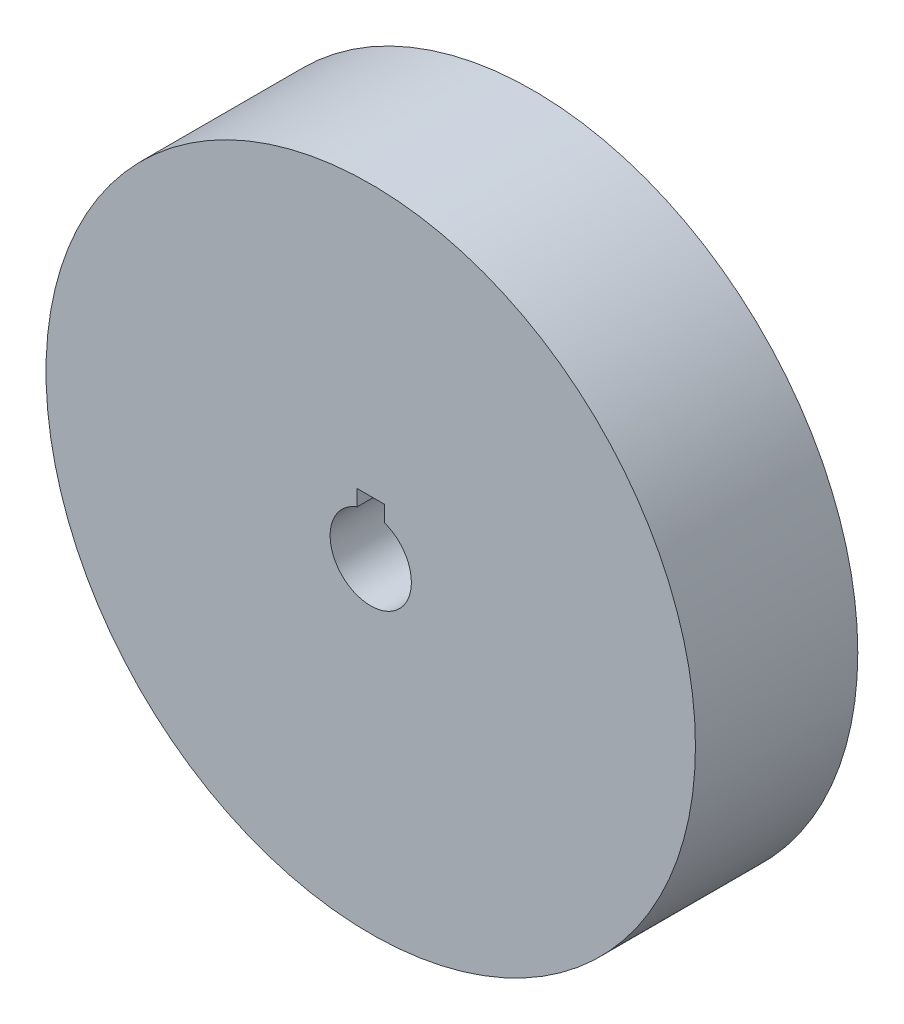
ISO-10303-21;
HEADER;
FILE_DESCRIPTION(('STEP AP214'),'2;1');
FILE_NAME('part.step','',(''),(''),'','','');
FILE_SCHEMA(('AUTOMOTIVE_DESIGN { 1 0 10303 214 1 1 1 1 }'));
ENDSEC;
DATA;
#1=APPLICATION_CONTEXT('core data for automotive mechanical design processes');
#2=APPLICATION_PROTOCOL_DEFINITION('international standard','automotive_design',2000,#1);
#3=PRODUCT_CONTEXT('',#1,'mechanical');
#4=PRODUCT('Part','Part','',(#3));
#5=PRODUCT_RELATED_PRODUCT_CATEGORY('part','',(#4));
#6=PRODUCT_DEFINITION_FORMATION('','',#4);
#7=PRODUCT_DEFINITION_CONTEXT('part definition',#1,'design');
#8=PRODUCT_DEFINITION('design','',#6,#7);
#9=PRODUCT_DEFINITION_SHAPE('','',#8);
#10=(LENGTH_UNIT() NAMED_UNIT(*) SI_UNIT(.MILLI.,.METRE.));
#11=(NAMED_UNIT(*) PLANE_ANGLE_UNIT() SI_UNIT($,.RADIAN.));
#12=(NAMED_UNIT(*) SI_UNIT($,.STERADIAN.) SOLID_ANGLE_UNIT());
#13=UNCERTAINTY_MEASURE_WITH_UNIT(LENGTH_MEASURE(1.E-05),#10,'distance_accuracy_value','');
#14=(GEOMETRIC_REPRESENTATION_CONTEXT(3) GLOBAL_UNCERTAINTY_ASSIGNED_CONTEXT((#13)) GLOBAL_UNIT_ASSIGNED_CONTEXT((#10,
#11,#12)) REPRESENTATION_CONTEXT('',''));
#15=CARTESIAN_POINT('',(0.,0.,0.));
#16=DIRECTION('',(0.,0.,1.));
#17=DIRECTION('',(1.,0.,0.));
#18=AXIS2_PLACEMENT_3D('',#15,#16,#17);
#19=CARTESIAN_POINT('',(0.,0.,38.1));
#20=DIRECTION('',(0.,0.,-1.));
#21=DIRECTION('',(-1.,0.,0.));
#22=AXIS2_PLACEMENT_3D('',#19,#20,#21);
#23=CYLINDRICAL_SURFACE('',#22,9.5377);
#24=CARTESIAN_POINT('',(0.,0.,0.));
#25=DIRECTION('',(0.,0.,1.));
#26=DIRECTION('',(1.,0.,0.));
#27=AXIS2_PLACEMENT_3D('',#24,#25,#26);
#28=CIRCLE('',#27,9.5377);
#29=CARTESIAN_POINT('',(-3.1877,8.98923189154669,0.));
#30=VERTEX_POINT('',#29);
#31=CARTESIAN_POINT('',(3.1877,8.98923189154669,0.));
#32=VERTEX_POINT('',#31);
#33=EDGE_CURVE('E104',#30,#32,#28,.T.);
#34=ORIENTED_EDGE('',*,*,#33,.F.);
#35=DIRECTION('',(0.,0.,-1.));
#36=VECTOR('',#35,1.);
#37=CARTESIAN_POINT('',(-3.1877,8.98923189154669,38.1));
#38=LINE('',#37,#36);
#39=CARTESIAN_POINT('',(-3.1877,8.98923189154669,38.1));
#40=VERTEX_POINT('',#39);
#41=EDGE_CURVE('E11',#40,#30,#38,.T.);
#42=ORIENTED_EDGE('',*,*,#41,.F.);
#43=CARTESIAN_POINT('',(0.,0.,38.1));
#44=DIRECTION('',(0.,0.,1.));
#45=DIRECTION('',(1.,0.,0.));
#46=AXIS2_PLACEMENT_3D('',#43,#44,#45);
#47=CIRCLE('',#46,9.5377);
#48=CARTESIAN_POINT('',(3.1877,8.98923189154669,38.1));
#49=VERTEX_POINT('',#48);
#50=EDGE_CURVE('E86',#40,#49,#47,.T.);
#51=ORIENTED_EDGE('',*,*,#50,.T.);
#52=DIRECTION('',(0.,0.,-1.));
#53=VECTOR('',#52,1.);
#54=CARTESIAN_POINT('',(3.1877,8.98923189154669,38.1));
#55=LINE('',#54,#53);
#56=EDGE_CURVE('E53',#49,#32,#55,.T.);
#57=ORIENTED_EDGE('',*,*,#56,.T.);
#58=EDGE_LOOP('',(#34,#42,#51,#57));
#59=FACE_BOUND('',#58,.T.);
#60=ADVANCED_FACE('F37',(#59),#23,.F.);
#61=CARTESIAN_POINT('',(-3.1877,0.,38.1));
#62=DIRECTION('',(-1.,0.,0.));
#63=DIRECTION('',(0.,0.,1.));
#64=AXIS2_PLACEMENT_3D('',#61,#62,#63);
#65=PLANE('',#64);
#66=DIRECTION('',(0.,1.,0.));
#67=VECTOR('',#66,1.);
#68=CARTESIAN_POINT('',(-3.1877,0.,0.));
#69=LINE('',#68,#67);
#70=CARTESIAN_POINT('',(-3.1877,12.7254,0.));
#71=VERTEX_POINT('',#70);
#72=EDGE_CURVE('E92',#30,#71,#69,.T.);
#73=ORIENTED_EDGE('',*,*,#72,.T.);
#74=DIRECTION('',(0.,0.,-1.));
#75=VECTOR('',#74,1.);
#76=CARTESIAN_POINT('',(-3.1877,12.7254,38.1));
#77=LINE('',#76,#75);
#78=CARTESIAN_POINT('',(-3.1877,12.7254,38.1));
#79=VERTEX_POINT('',#78);
#80=EDGE_CURVE('E45',#79,#71,#77,.T.);
#81=ORIENTED_EDGE('',*,*,#80,.F.);
#82=DIRECTION('',(0.,1.,0.));
#83=VECTOR('',#82,1.);
#84=CARTESIAN_POINT('',(-3.1877,0.,38.1));
#85=LINE('',#84,#83);
#86=EDGE_CURVE('E79',#40,#79,#85,.T.);
#87=ORIENTED_EDGE('',*,*,#86,.F.);
#88=ORIENTED_EDGE('',*,*,#41,.T.);
#89=EDGE_LOOP('',(#73,#81,#87,#88));
#90=FACE_BOUND('',#89,.T.);
#91=ADVANCED_FACE('F90',(#90),#65,.F.);
#92=CARTESIAN_POINT('',(0.,12.7254,38.1));
#93=DIRECTION('',(0.,1.,0.));
#94=DIRECTION('',(0.,0.,1.));
#95=AXIS2_PLACEMENT_3D('',#92,#93,#94);
#96=PLANE('',#95);
#97=DIRECTION('',(1.,0.,0.));
#98=VECTOR('',#97,1.);
#99=CARTESIAN_POINT('',(0.,12.7254,0.));
#100=LINE('',#99,#98);
#101=CARTESIAN_POINT('',(3.1877,12.7254,0.));
#102=VERTEX_POINT('',#101);
#103=EDGE_CURVE('E107',#71,#102,#100,.T.);
#104=ORIENTED_EDGE('',*,*,#103,.T.);
#105=DIRECTION('',(0.,0.,-1.));
#106=VECTOR('',#105,1.);
#107=CARTESIAN_POINT('',(3.1877,12.7254,38.1));
#108=LINE('',#107,#106);
#109=CARTESIAN_POINT('',(3.1877,12.7254,38.1));
#110=VERTEX_POINT('',#109);
#111=EDGE_CURVE('E67',#110,#102,#108,.T.);
#112=ORIENTED_EDGE('',*,*,#111,.F.);
#113=DIRECTION('',(1.,0.,0.));
#114=VECTOR('',#113,1.);
#115=CARTESIAN_POINT('',(0.,12.7254,38.1));
#116=LINE('',#115,#114);
#117=EDGE_CURVE('E85',#79,#110,#116,.T.);
#118=ORIENTED_EDGE('',*,*,#117,.F.);
#119=ORIENTED_EDGE('',*,*,#80,.T.);
#120=EDGE_LOOP('',(#104,#112,#118,#119));
#121=FACE_BOUND('',#120,.T.);
#122=ADVANCED_FACE('F95',(#121),#96,.F.);
#123=CARTESIAN_POINT('',(3.1877,0.,38.1));
#124=DIRECTION('',(-1.,0.,0.));
#125=DIRECTION('',(0.,0.,1.));
#126=AXIS2_PLACEMENT_3D('',#123,#124,#125);
#127=PLANE('',#126);
#128=DIRECTION('',(0.,1.,0.));
#129=VECTOR('',#128,1.);
#130=CARTESIAN_POINT('',(3.1877,0.,0.));
#131=LINE('',#130,#129);
#132=EDGE_CURVE('E109',#32,#102,#131,.T.);
#133=ORIENTED_EDGE('',*,*,#132,.F.);
#134=ORIENTED_EDGE('',*,*,#56,.F.);
#135=DIRECTION('',(0.,1.,0.));
#136=VECTOR('',#135,1.);
#137=CARTESIAN_POINT('',(3.1877,0.,38.1));
#138=LINE('',#137,#136);
#139=EDGE_CURVE('E96',#49,#110,#138,.T.);
#140=ORIENTED_EDGE('',*,*,#139,.T.);
#141=ORIENTED_EDGE('',*,*,#111,.T.);
#142=EDGE_LOOP('',(#133,#134,#140,#141));
#143=FACE_BOUND('',#142,.T.);
#144=ADVANCED_FACE('F118',(#143),#127,.T.);
#145=CARTESIAN_POINT('',(0.,0.,38.1));
#146=DIRECTION('',(0.,0.,-1.));
#147=DIRECTION('',(-1.,0.,0.));
#148=AXIS2_PLACEMENT_3D('',#145,#146,#147);
#149=CYLINDRICAL_SURFACE('',#148,76.2);
#150=CARTESIAN_POINT('',(0.,0.,38.1));
#151=DIRECTION('',(0.,0.,1.));
#152=DIRECTION('',(1.,0.,0.));
#153=AXIS2_PLACEMENT_3D('',#150,#151,#152);
#154=CIRCLE('',#153,76.2);
#155=CARTESIAN_POINT('',(76.2,0.,38.1));
#156=VERTEX_POINT('',#155);
#157=EDGE_CURVE('E98',#156,#156,#154,.T.);
#158=ORIENTED_EDGE('',*,*,#157,.F.);
#159=EDGE_LOOP('',(#158));
#160=FACE_BOUND('',#159,.T.);
#161=CARTESIAN_POINT('',(0.,0.,0.));
#162=DIRECTION('',(0.,0.,1.));
#163=DIRECTION('',(1.,0.,0.));
#164=AXIS2_PLACEMENT_3D('',#161,#162,#163);
#165=CIRCLE('',#164,76.2);
#166=CARTESIAN_POINT('',(76.2,0.,0.));
#167=VERTEX_POINT('',#166);
#168=EDGE_CURVE('E112',#167,#167,#165,.T.);
#169=ORIENTED_EDGE('',*,*,#168,.T.);
#170=EDGE_LOOP('',(#169));
#171=FACE_BOUND('',#170,.T.);
#172=ADVANCED_FACE('F120',(#160,#171),#149,.T.);
#173=CARTESIAN_POINT('',(0.,0.,38.1));
#174=DIRECTION('',(0.,0.,1.));
#175=DIRECTION('',(1.,0.,0.));
#176=AXIS2_PLACEMENT_3D('',#173,#174,#175);
#177=PLANE('',#176);
#178=ORIENTED_EDGE('',*,*,#50,.F.);
#179=ORIENTED_EDGE('',*,*,#86,.T.);
#180=ORIENTED_EDGE('',*,*,#117,.T.);
#181=ORIENTED_EDGE('',*,*,#139,.F.);
#182=EDGE_LOOP('',(#178,#179,#180,#181));
#183=FACE_BOUND('',#182,.T.);
#184=ORIENTED_EDGE('',*,*,#157,.T.);
#185=EDGE_LOOP('',(#184));
#186=FACE_BOUND('',#185,.T.);
#187=ADVANCED_FACE('F81',(#183,#186),#177,.T.);
#188=CARTESIAN_POINT('',(0.,0.,0.));
#189=DIRECTION('',(0.,0.,1.));
#190=DIRECTION('',(1.,0.,0.));
#191=AXIS2_PLACEMENT_3D('',#188,#189,#190);
#192=PLANE('',#191);
#193=ORIENTED_EDGE('',*,*,#33,.T.);
#194=ORIENTED_EDGE('',*,*,#132,.T.);
#195=ORIENTED_EDGE('',*,*,#103,.F.);
#196=ORIENTED_EDGE('',*,*,#72,.F.);
#197=EDGE_LOOP('',(#193,#194,#195,#196));
#198=FACE_BOUND('',#197,.T.);
#199=ORIENTED_EDGE('',*,*,#168,.F.);
#200=EDGE_LOOP('',(#199));
#201=FACE_BOUND('',#200,.T.);
#202=ADVANCED_FACE('F161',(#198,#201),#192,.F.);
#203=CLOSED_SHELL('',(#60,#91,#122,#144,#172,#187,#202));
#204=MANIFOLD_SOLID_BREP('B2',#203);
#205=ADVANCED_BREP_SHAPE_REPRESENTATION('',(#18,#204),#14);
#206=SHAPE_DEFINITION_REPRESENTATION(#9,#205);
ENDSEC;
END-ISO-10303-21;
